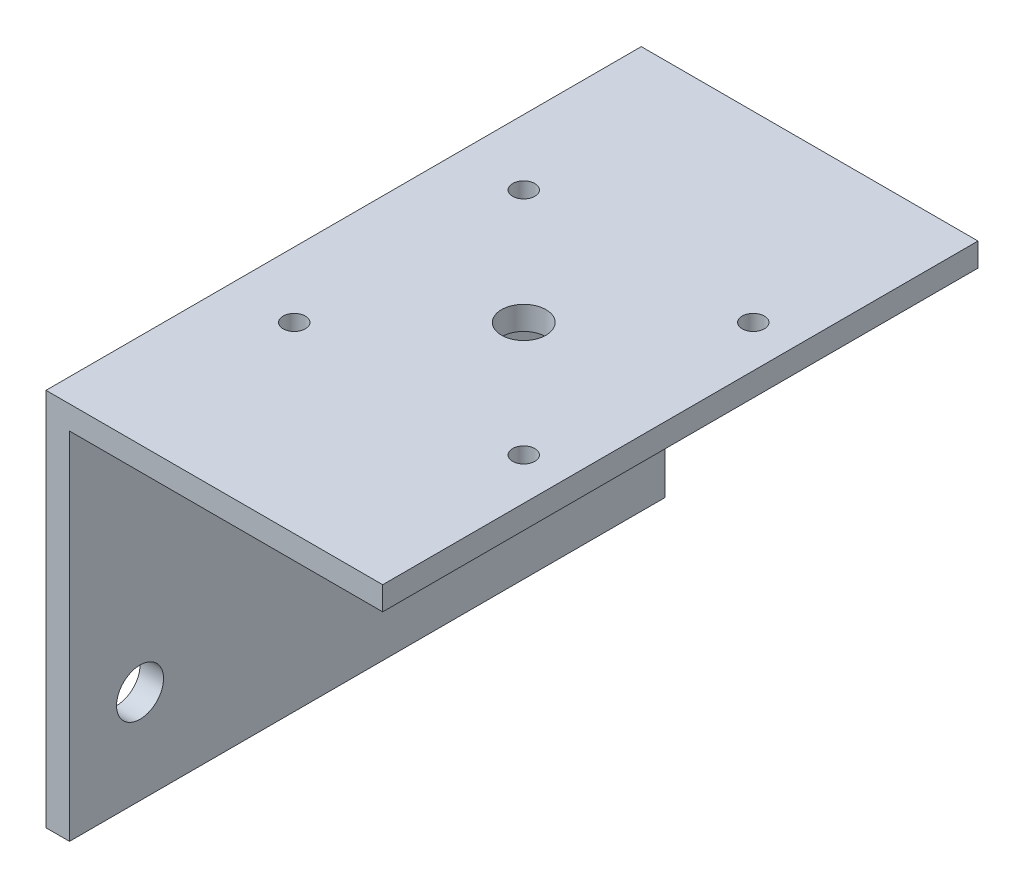
ISO-10303-21;
HEADER;
FILE_DESCRIPTION(('STEP AP214'),'2;1');
FILE_NAME('part.step','',(''),(''),'','','');
FILE_SCHEMA(('AUTOMOTIVE_DESIGN { 1 0 10303 214 1 1 1 1 }'));
ENDSEC;
DATA;
#1=APPLICATION_CONTEXT('core data for automotive mechanical design processes');
#2=APPLICATION_PROTOCOL_DEFINITION('international standard','automotive_design',2000,#1);
#3=PRODUCT_CONTEXT('',#1,'mechanical');
#4=PRODUCT('Part','Part','',(#3));
#5=PRODUCT_RELATED_PRODUCT_CATEGORY('part','',(#4));
#6=PRODUCT_DEFINITION_FORMATION('','',#4);
#7=PRODUCT_DEFINITION_CONTEXT('part definition',#1,'design');
#8=PRODUCT_DEFINITION('design','',#6,#7);
#9=PRODUCT_DEFINITION_SHAPE('','',#8);
#10=(LENGTH_UNIT() NAMED_UNIT(*) SI_UNIT(.MILLI.,.METRE.));
#11=(NAMED_UNIT(*) PLANE_ANGLE_UNIT() SI_UNIT($,.RADIAN.));
#12=(NAMED_UNIT(*) SI_UNIT($,.STERADIAN.) SOLID_ANGLE_UNIT());
#13=UNCERTAINTY_MEASURE_WITH_UNIT(LENGTH_MEASURE(1.E-05),#10,'distance_accuracy_value','');
#14=(GEOMETRIC_REPRESENTATION_CONTEXT(3) GLOBAL_UNCERTAINTY_ASSIGNED_CONTEXT((#13)) GLOBAL_UNIT_ASSIGNED_CONTEXT((#10,
#11,#12)) REPRESENTATION_CONTEXT('',''));
#15=CARTESIAN_POINT('',(0.,0.,0.));
#16=DIRECTION('',(0.,0.,1.));
#17=DIRECTION('',(1.,0.,0.));
#18=AXIS2_PLACEMENT_3D('',#15,#16,#17);
#19=CARTESIAN_POINT('',(0.,0.,80.4));
#20=DIRECTION('',(1.,0.,0.));
#21=DIRECTION('',(0.,0.,-1.));
#22=AXIS2_PLACEMENT_3D('',#19,#20,#21);
#23=PLANE('',#22);
#24=CARTESIAN_POINT('',(0.,12.7,9.52500000000001));
#25=DIRECTION('',(1.,0.,0.));
#26=DIRECTION('',(0.,0.,-1.));
#27=AXIS2_PLACEMENT_3D('',#24,#25,#26);
#28=CIRCLE('',#27,3.175);
#29=CARTESIAN_POINT('',(0.,12.7,6.35000000000001));
#30=VERTEX_POINT('',#29);
#31=EDGE_CURVE('E162',#30,#30,#28,.T.);
#32=ORIENTED_EDGE('',*,*,#31,.T.);
#33=EDGE_LOOP('',(#32));
#34=FACE_BOUND('',#33,.T.);
#35=CARTESIAN_POINT('',(0.,12.7,70.875));
#36=DIRECTION('',(1.,0.,0.));
#37=DIRECTION('',(0.,0.,-1.));
#38=AXIS2_PLACEMENT_3D('',#35,#36,#37);
#39=CIRCLE('',#38,3.175);
#40=CARTESIAN_POINT('',(0.,12.7,67.7));
#41=VERTEX_POINT('',#40);
#42=EDGE_CURVE('E120',#41,#41,#39,.T.);
#43=ORIENTED_EDGE('',*,*,#42,.T.);
#44=EDGE_LOOP('',(#43));
#45=FACE_BOUND('',#44,.T.);
#46=DIRECTION('',(0.,-1.,0.));
#47=VECTOR('',#46,1.);
#48=CARTESIAN_POINT('',(0.,0.,0.));
#49=LINE('',#48,#47);
#50=CARTESIAN_POINT('',(0.,51.175,0.));
#51=VERTEX_POINT('',#50);
#52=CARTESIAN_POINT('',(0.,0.,0.));
#53=VERTEX_POINT('',#52);
#54=EDGE_CURVE('E116',#51,#53,#49,.T.);
#55=ORIENTED_EDGE('',*,*,#54,.T.);
#56=DIRECTION('',(0.,0.,-1.));
#57=VECTOR('',#56,1.);
#58=CARTESIAN_POINT('',(0.,0.,80.4));
#59=LINE('',#58,#57);
#60=CARTESIAN_POINT('',(0.,0.,80.4));
#61=VERTEX_POINT('',#60);
#62=EDGE_CURVE('E11',#61,#53,#59,.T.);
#63=ORIENTED_EDGE('',*,*,#62,.F.);
#64=DIRECTION('',(0.,-1.,0.));
#65=VECTOR('',#64,1.);
#66=CARTESIAN_POINT('',(0.,0.,80.4));
#67=LINE('',#66,#65);
#68=CARTESIAN_POINT('',(0.,51.175,80.4));
#69=VERTEX_POINT('',#68);
#70=EDGE_CURVE('E127',#69,#61,#67,.T.);
#71=ORIENTED_EDGE('',*,*,#70,.F.);
#72=DIRECTION('',(0.,0.,-1.));
#73=VECTOR('',#72,1.);
#74=CARTESIAN_POINT('',(0.,51.175,80.4));
#75=LINE('',#74,#73);
#76=EDGE_CURVE('E112',#69,#51,#75,.T.);
#77=ORIENTED_EDGE('',*,*,#76,.T.);
#78=EDGE_LOOP('',(#55,#63,#71,#77));
#79=FACE_BOUND('',#78,.T.);
#80=ADVANCED_FACE('F32',(#34,#45,#79),#23,.F.);
#81=CARTESIAN_POINT('',(0.,0.,80.4));
#82=DIRECTION('',(0.,1.,0.));
#83=DIRECTION('',(-1.,0.,0.));
#84=AXIS2_PLACEMENT_3D('',#81,#82,#83);
#85=PLANE('',#84);
#86=DIRECTION('',(1.,0.,0.));
#87=VECTOR('',#86,1.);
#88=CARTESIAN_POINT('',(0.,0.,0.));
#89=LINE('',#88,#87);
#90=CARTESIAN_POINT('',(3.175,0.,0.));
#91=VERTEX_POINT('',#90);
#92=EDGE_CURVE('E119',#53,#91,#89,.T.);
#93=ORIENTED_EDGE('',*,*,#92,.T.);
#94=DIRECTION('',(0.,0.,-1.));
#95=VECTOR('',#94,1.);
#96=CARTESIAN_POINT('',(3.175,0.,80.4));
#97=LINE('',#96,#95);
#98=CARTESIAN_POINT('',(3.175,0.,80.4));
#99=VERTEX_POINT('',#98);
#100=EDGE_CURVE('E40',#99,#91,#97,.T.);
#101=ORIENTED_EDGE('',*,*,#100,.F.);
#102=DIRECTION('',(1.,0.,0.));
#103=VECTOR('',#102,1.);
#104=CARTESIAN_POINT('',(0.,0.,80.4));
#105=LINE('',#104,#103);
#106=EDGE_CURVE('E85',#61,#99,#105,.T.);
#107=ORIENTED_EDGE('',*,*,#106,.F.);
#108=ORIENTED_EDGE('',*,*,#62,.T.);
#109=EDGE_LOOP('',(#93,#101,#107,#108));
#110=FACE_BOUND('',#109,.T.);
#111=ADVANCED_FACE('F154',(#110),#85,.F.);
#112=CARTESIAN_POINT('',(3.175,0.,80.4));
#113=DIRECTION('',(-1.,0.,0.));
#114=DIRECTION('',(0.,0.,1.));
#115=AXIS2_PLACEMENT_3D('',#112,#113,#114);
#116=PLANE('',#115);
#117=CARTESIAN_POINT('',(3.175,12.7,9.52500000000001));
#118=DIRECTION('',(1.,0.,0.));
#119=DIRECTION('',(0.,0.,-1.));
#120=AXIS2_PLACEMENT_3D('',#117,#118,#119);
#121=CIRCLE('',#120,3.175);
#122=CARTESIAN_POINT('',(3.175,12.7,6.35000000000001));
#123=VERTEX_POINT('',#122);
#124=EDGE_CURVE('E171',#123,#123,#121,.T.);
#125=ORIENTED_EDGE('',*,*,#124,.F.);
#126=EDGE_LOOP('',(#125));
#127=FACE_BOUND('',#126,.T.);
#128=CARTESIAN_POINT('',(3.175,12.7,70.875));
#129=DIRECTION('',(1.,0.,0.));
#130=DIRECTION('',(0.,0.,-1.));
#131=AXIS2_PLACEMENT_3D('',#128,#129,#130);
#132=CIRCLE('',#131,3.175);
#133=CARTESIAN_POINT('',(3.175,12.7,67.7));
#134=VERTEX_POINT('',#133);
#135=EDGE_CURVE('E166',#134,#134,#132,.T.);
#136=ORIENTED_EDGE('',*,*,#135,.F.);
#137=EDGE_LOOP('',(#136));
#138=FACE_BOUND('',#137,.T.);
#139=DIRECTION('',(0.,1.,0.));
#140=VECTOR('',#139,1.);
#141=CARTESIAN_POINT('',(3.175,0.,0.));
#142=LINE('',#141,#140);
#143=CARTESIAN_POINT('',(3.175,48.,0.));
#144=VERTEX_POINT('',#143);
#145=EDGE_CURVE('E122',#91,#144,#142,.T.);
#146=ORIENTED_EDGE('',*,*,#145,.T.);
#147=DIRECTION('',(0.,0.,-1.));
#148=VECTOR('',#147,1.);
#149=CARTESIAN_POINT('',(3.175,48.,80.4));
#150=LINE('',#149,#148);
#151=CARTESIAN_POINT('',(3.175,48.,80.4));
#152=VERTEX_POINT('',#151);
#153=EDGE_CURVE('E107',#152,#144,#150,.T.);
#154=ORIENTED_EDGE('',*,*,#153,.F.);
#155=DIRECTION('',(0.,1.,0.));
#156=VECTOR('',#155,1.);
#157=CARTESIAN_POINT('',(3.175,0.,80.4));
#158=LINE('',#157,#156);
#159=EDGE_CURVE('E98',#99,#152,#158,.T.);
#160=ORIENTED_EDGE('',*,*,#159,.F.);
#161=ORIENTED_EDGE('',*,*,#100,.T.);
#162=EDGE_LOOP('',(#146,#154,#160,#161));
#163=FACE_BOUND('',#162,.T.);
#164=ADVANCED_FACE('F133',(#127,#138,#163),#116,.F.);
#165=CARTESIAN_POINT('',(45.475,48.,80.4));
#166=DIRECTION('',(0.,1.,0.));
#167=DIRECTION('',(-1.,0.,0.));
#168=AXIS2_PLACEMENT_3D('',#165,#166,#167);
#169=PLANE('',#168);
#170=CARTESIAN_POINT('',(24.325,48.,40.2));
#171=DIRECTION('',(0.,1.,0.));
#172=DIRECTION('',(-1.,0.,0.));
#173=AXIS2_PLACEMENT_3D('',#170,#171,#172);
#174=CIRCLE('',#173,3.);
#175=CARTESIAN_POINT('',(21.325,48.,40.2));
#176=VERTEX_POINT('',#175);
#177=EDGE_CURVE('E201',#176,#176,#174,.T.);
#178=ORIENTED_EDGE('',*,*,#177,.T.);
#179=EDGE_LOOP('',(#178));
#180=FACE_BOUND('',#179,.T.);
#181=CARTESIAN_POINT('',(39.825,48.,24.7));
#182=DIRECTION('',(0.,1.,0.));
#183=DIRECTION('',(-1.,0.,0.));
#184=AXIS2_PLACEMENT_3D('',#181,#182,#183);
#185=CIRCLE('',#184,1.5);
#186=CARTESIAN_POINT('',(38.325,48.,24.7));
#187=VERTEX_POINT('',#186);
#188=EDGE_CURVE('E195',#187,#187,#185,.T.);
#189=ORIENTED_EDGE('',*,*,#188,.T.);
#190=EDGE_LOOP('',(#189));
#191=FACE_BOUND('',#190,.T.);
#192=CARTESIAN_POINT('',(8.825,48.,24.7));
#193=DIRECTION('',(0.,1.,0.));
#194=DIRECTION('',(-1.,0.,0.));
#195=AXIS2_PLACEMENT_3D('',#192,#193,#194);
#196=CIRCLE('',#195,1.5);
#197=CARTESIAN_POINT('',(7.325,48.,24.7));
#198=VERTEX_POINT('',#197);
#199=EDGE_CURVE('E189',#198,#198,#196,.T.);
#200=ORIENTED_EDGE('',*,*,#199,.T.);
#201=EDGE_LOOP('',(#200));
#202=FACE_BOUND('',#201,.T.);
#203=CARTESIAN_POINT('',(8.82500000000001,48.,55.7));
#204=DIRECTION('',(0.,1.,0.));
#205=DIRECTION('',(-1.,0.,0.));
#206=AXIS2_PLACEMENT_3D('',#203,#204,#205);
#207=CIRCLE('',#206,1.5);
#208=CARTESIAN_POINT('',(7.32500000000001,48.,55.7));
#209=VERTEX_POINT('',#208);
#210=EDGE_CURVE('E183',#209,#209,#207,.T.);
#211=ORIENTED_EDGE('',*,*,#210,.T.);
#212=EDGE_LOOP('',(#211));
#213=FACE_BOUND('',#212,.T.);
#214=CARTESIAN_POINT('',(39.825,48.,55.7));
#215=DIRECTION('',(0.,1.,0.));
#216=DIRECTION('',(-1.,0.,0.));
#217=AXIS2_PLACEMENT_3D('',#214,#215,#216);
#218=CIRCLE('',#217,1.5);
#219=CARTESIAN_POINT('',(38.325,48.,55.7));
#220=VERTEX_POINT('',#219);
#221=EDGE_CURVE('E176',#220,#220,#218,.T.);
#222=ORIENTED_EDGE('',*,*,#221,.T.);
#223=EDGE_LOOP('',(#222));
#224=FACE_BOUND('',#223,.T.);
#225=DIRECTION('',(1.,0.,0.));
#226=VECTOR('',#225,1.);
#227=CARTESIAN_POINT('',(45.475,48.,0.));
#228=LINE('',#227,#226);
#229=CARTESIAN_POINT('',(45.475,48.,0.));
#230=VERTEX_POINT('',#229);
#231=EDGE_CURVE('E106',#144,#230,#228,.T.);
#232=ORIENTED_EDGE('',*,*,#231,.T.);
#233=DIRECTION('',(0.,0.,-1.));
#234=VECTOR('',#233,1.);
#235=CARTESIAN_POINT('',(45.475,48.,80.4));
#236=LINE('',#235,#234);
#237=CARTESIAN_POINT('',(45.475,48.,80.4));
#238=VERTEX_POINT('',#237);
#239=EDGE_CURVE('E103',#238,#230,#236,.T.);
#240=ORIENTED_EDGE('',*,*,#239,.F.);
#241=DIRECTION('',(1.,0.,0.));
#242=VECTOR('',#241,1.);
#243=CARTESIAN_POINT('',(45.475,48.,80.4));
#244=LINE('',#243,#242);
#245=EDGE_CURVE('E92',#152,#238,#244,.T.);
#246=ORIENTED_EDGE('',*,*,#245,.F.);
#247=ORIENTED_EDGE('',*,*,#153,.T.);
#248=EDGE_LOOP('',(#232,#240,#246,#247));
#249=FACE_BOUND('',#248,.T.);
#250=ADVANCED_FACE('F104',(#180,#191,#202,#213,#224,#249),#169,.F.);
#251=CARTESIAN_POINT('',(45.475,48.,80.4));
#252=DIRECTION('',(-1.,0.,0.));
#253=DIRECTION('',(0.,0.,1.));
#254=AXIS2_PLACEMENT_3D('',#251,#252,#253);
#255=PLANE('',#254);
#256=DIRECTION('',(0.,1.,0.));
#257=VECTOR('',#256,1.);
#258=CARTESIAN_POINT('',(45.475,48.,0.));
#259=LINE('',#258,#257);
#260=CARTESIAN_POINT('',(45.475,51.175,0.));
#261=VERTEX_POINT('',#260);
#262=EDGE_CURVE('E71',#230,#261,#259,.T.);
#263=ORIENTED_EDGE('',*,*,#262,.T.);
#264=DIRECTION('',(0.,0.,-1.));
#265=VECTOR('',#264,1.);
#266=CARTESIAN_POINT('',(45.475,51.175,80.4));
#267=LINE('',#266,#265);
#268=CARTESIAN_POINT('',(45.475,51.175,80.4));
#269=VERTEX_POINT('',#268);
#270=EDGE_CURVE('E108',#269,#261,#267,.T.);
#271=ORIENTED_EDGE('',*,*,#270,.F.);
#272=DIRECTION('',(0.,1.,0.));
#273=VECTOR('',#272,1.);
#274=CARTESIAN_POINT('',(45.475,48.,80.4));
#275=LINE('',#274,#273);
#276=EDGE_CURVE('E96',#238,#269,#275,.T.);
#277=ORIENTED_EDGE('',*,*,#276,.F.);
#278=ORIENTED_EDGE('',*,*,#239,.T.);
#279=EDGE_LOOP('',(#263,#271,#277,#278));
#280=FACE_BOUND('',#279,.T.);
#281=ADVANCED_FACE('F110',(#280),#255,.F.);
#282=CARTESIAN_POINT('',(0.,51.175,80.4));
#283=DIRECTION('',(0.,-1.,0.));
#284=DIRECTION('',(0.,0.,-1.));
#285=AXIS2_PLACEMENT_3D('',#282,#283,#284);
#286=PLANE('',#285);
#287=CARTESIAN_POINT('',(24.325,51.175,40.2));
#288=DIRECTION('',(0.,1.,0.));
#289=DIRECTION('',(0.,0.,1.));
#290=AXIS2_PLACEMENT_3D('',#287,#288,#289);
#291=CIRCLE('',#290,3.);
#292=CARTESIAN_POINT('',(24.325,51.175,43.2));
#293=VERTEX_POINT('',#292);
#294=EDGE_CURVE('E204',#293,#293,#291,.T.);
#295=ORIENTED_EDGE('',*,*,#294,.F.);
#296=EDGE_LOOP('',(#295));
#297=FACE_BOUND('',#296,.T.);
#298=CARTESIAN_POINT('',(39.825,51.175,24.7));
#299=DIRECTION('',(0.,1.,0.));
#300=DIRECTION('',(0.,0.,1.));
#301=AXIS2_PLACEMENT_3D('',#298,#299,#300);
#302=CIRCLE('',#301,1.5);
#303=CARTESIAN_POINT('',(39.825,51.175,26.2));
#304=VERTEX_POINT('',#303);
#305=EDGE_CURVE('E198',#304,#304,#302,.T.);
#306=ORIENTED_EDGE('',*,*,#305,.F.);
#307=EDGE_LOOP('',(#306));
#308=FACE_BOUND('',#307,.T.);
#309=CARTESIAN_POINT('',(8.825,51.175,24.7));
#310=DIRECTION('',(0.,1.,0.));
#311=DIRECTION('',(0.,0.,1.));
#312=AXIS2_PLACEMENT_3D('',#309,#310,#311);
#313=CIRCLE('',#312,1.5);
#314=CARTESIAN_POINT('',(8.825,51.175,26.2));
#315=VERTEX_POINT('',#314);
#316=EDGE_CURVE('E192',#315,#315,#313,.T.);
#317=ORIENTED_EDGE('',*,*,#316,.F.);
#318=EDGE_LOOP('',(#317));
#319=FACE_BOUND('',#318,.T.);
#320=CARTESIAN_POINT('',(8.82500000000001,51.175,55.7));
#321=DIRECTION('',(0.,1.,0.));
#322=DIRECTION('',(0.,0.,1.));
#323=AXIS2_PLACEMENT_3D('',#320,#321,#322);
#324=CIRCLE('',#323,1.5);
#325=CARTESIAN_POINT('',(8.82500000000001,51.175,57.2));
#326=VERTEX_POINT('',#325);
#327=EDGE_CURVE('E186',#326,#326,#324,.T.);
#328=ORIENTED_EDGE('',*,*,#327,.F.);
#329=EDGE_LOOP('',(#328));
#330=FACE_BOUND('',#329,.T.);
#331=CARTESIAN_POINT('',(39.825,51.175,55.7));
#332=DIRECTION('',(0.,1.,0.));
#333=DIRECTION('',(0.,0.,1.));
#334=AXIS2_PLACEMENT_3D('',#331,#332,#333);
#335=CIRCLE('',#334,1.5);
#336=CARTESIAN_POINT('',(39.825,51.175,57.2));
#337=VERTEX_POINT('',#336);
#338=EDGE_CURVE('E180',#337,#337,#335,.T.);
#339=ORIENTED_EDGE('',*,*,#338,.F.);
#340=EDGE_LOOP('',(#339));
#341=FACE_BOUND('',#340,.T.);
#342=DIRECTION('',(-1.,0.,0.));
#343=VECTOR('',#342,1.);
#344=CARTESIAN_POINT('',(0.,51.175,0.));
#345=LINE('',#344,#343);
#346=EDGE_CURVE('E77',#261,#51,#345,.T.);
#347=ORIENTED_EDGE('',*,*,#346,.T.);
#348=ORIENTED_EDGE('',*,*,#76,.F.);
#349=DIRECTION('',(-1.,0.,0.));
#350=VECTOR('',#349,1.);
#351=CARTESIAN_POINT('',(0.,51.175,80.4));
#352=LINE('',#351,#350);
#353=EDGE_CURVE('E48',#269,#69,#352,.T.);
#354=ORIENTED_EDGE('',*,*,#353,.F.);
#355=ORIENTED_EDGE('',*,*,#270,.T.);
#356=EDGE_LOOP('',(#347,#348,#354,#355));
#357=FACE_BOUND('',#356,.T.);
#358=ADVANCED_FACE('F140',(#297,#308,#319,#330,#341,#357),#286,.F.);
#359=CARTESIAN_POINT('',(0.,0.,80.4));
#360=DIRECTION('',(0.,0.,-1.));
#361=DIRECTION('',(-1.,0.,0.));
#362=AXIS2_PLACEMENT_3D('',#359,#360,#361);
#363=PLANE('',#362);
#364=ORIENTED_EDGE('',*,*,#70,.T.);
#365=ORIENTED_EDGE('',*,*,#106,.T.);
#366=ORIENTED_EDGE('',*,*,#159,.T.);
#367=ORIENTED_EDGE('',*,*,#245,.T.);
#368=ORIENTED_EDGE('',*,*,#276,.T.);
#369=ORIENTED_EDGE('',*,*,#353,.T.);
#370=EDGE_LOOP('',(#364,#365,#366,#367,#368,#369));
#371=FACE_BOUND('',#370,.T.);
#372=ADVANCED_FACE('F94',(#371),#363,.F.);
#373=CARTESIAN_POINT('',(0.,0.,0.));
#374=DIRECTION('',(0.,0.,-1.));
#375=DIRECTION('',(-1.,0.,0.));
#376=AXIS2_PLACEMENT_3D('',#373,#374,#375);
#377=PLANE('',#376);
#378=ORIENTED_EDGE('',*,*,#54,.F.);
#379=ORIENTED_EDGE('',*,*,#346,.F.);
#380=ORIENTED_EDGE('',*,*,#262,.F.);
#381=ORIENTED_EDGE('',*,*,#231,.F.);
#382=ORIENTED_EDGE('',*,*,#145,.F.);
#383=ORIENTED_EDGE('',*,*,#92,.F.);
#384=EDGE_LOOP('',(#378,#379,#380,#381,#382,#383));
#385=FACE_BOUND('',#384,.T.);
#386=ADVANCED_FACE('F136',(#385),#377,.T.);
#387=CARTESIAN_POINT('',(0.,12.7,70.875));
#388=DIRECTION('',(1.,0.,0.));
#389=DIRECTION('',(0.,0.,-1.));
#390=AXIS2_PLACEMENT_3D('',#387,#388,#389);
#391=CYLINDRICAL_SURFACE('',#390,3.175);
#392=ORIENTED_EDGE('',*,*,#42,.F.);
#393=EDGE_LOOP('',(#392));
#394=FACE_BOUND('',#393,.T.);
#395=ORIENTED_EDGE('',*,*,#135,.T.);
#396=EDGE_LOOP('',(#395));
#397=FACE_BOUND('',#396,.T.);
#398=ADVANCED_FACE('F238',(#394,#397),#391,.F.);
#399=CARTESIAN_POINT('',(0.,12.7,9.52500000000001));
#400=DIRECTION('',(1.,0.,0.));
#401=DIRECTION('',(0.,0.,-1.));
#402=AXIS2_PLACEMENT_3D('',#399,#400,#401);
#403=CYLINDRICAL_SURFACE('',#402,3.175);
#404=ORIENTED_EDGE('',*,*,#31,.F.);
#405=EDGE_LOOP('',(#404));
#406=FACE_BOUND('',#405,.T.);
#407=ORIENTED_EDGE('',*,*,#124,.T.);
#408=EDGE_LOOP('',(#407));
#409=FACE_BOUND('',#408,.T.);
#410=ADVANCED_FACE('F228',(#406,#409),#403,.F.);
#411=CARTESIAN_POINT('',(39.825,0.,55.7));
#412=DIRECTION('',(0.,1.,0.));
#413=DIRECTION('',(0.,0.,1.));
#414=AXIS2_PLACEMENT_3D('',#411,#412,#413);
#415=CYLINDRICAL_SURFACE('',#414,1.5);
#416=ORIENTED_EDGE('',*,*,#338,.T.);
#417=EDGE_LOOP('',(#416));
#418=FACE_BOUND('',#417,.T.);
#419=ORIENTED_EDGE('',*,*,#221,.F.);
#420=EDGE_LOOP('',(#419));
#421=FACE_BOUND('',#420,.T.);
#422=ADVANCED_FACE('F225',(#418,#421),#415,.F.);
#423=CARTESIAN_POINT('',(8.82500000000001,0.,55.7));
#424=DIRECTION('',(0.,1.,0.));
#425=DIRECTION('',(0.,0.,1.));
#426=AXIS2_PLACEMENT_3D('',#423,#424,#425);
#427=CYLINDRICAL_SURFACE('',#426,1.5);
#428=ORIENTED_EDGE('',*,*,#327,.T.);
#429=EDGE_LOOP('',(#428));
#430=FACE_BOUND('',#429,.T.);
#431=ORIENTED_EDGE('',*,*,#210,.F.);
#432=EDGE_LOOP('',(#431));
#433=FACE_BOUND('',#432,.T.);
#434=ADVANCED_FACE('F227',(#430,#433),#427,.F.);
#435=CARTESIAN_POINT('',(8.825,0.,24.7));
#436=DIRECTION('',(0.,1.,0.));
#437=DIRECTION('',(0.,0.,1.));
#438=AXIS2_PLACEMENT_3D('',#435,#436,#437);
#439=CYLINDRICAL_SURFACE('',#438,1.5);
#440=ORIENTED_EDGE('',*,*,#316,.T.);
#441=EDGE_LOOP('',(#440));
#442=FACE_BOUND('',#441,.T.);
#443=ORIENTED_EDGE('',*,*,#199,.F.);
#444=EDGE_LOOP('',(#443));
#445=FACE_BOUND('',#444,.T.);
#446=ADVANCED_FACE('F235',(#442,#445),#439,.F.);
#447=CARTESIAN_POINT('',(39.825,0.,24.7));
#448=DIRECTION('',(0.,1.,0.));
#449=DIRECTION('',(0.,0.,1.));
#450=AXIS2_PLACEMENT_3D('',#447,#448,#449);
#451=CYLINDRICAL_SURFACE('',#450,1.5);
#452=ORIENTED_EDGE('',*,*,#305,.T.);
#453=EDGE_LOOP('',(#452));
#454=FACE_BOUND('',#453,.T.);
#455=ORIENTED_EDGE('',*,*,#188,.F.);
#456=EDGE_LOOP('',(#455));
#457=FACE_BOUND('',#456,.T.);
#458=ADVANCED_FACE('F210',(#454,#457),#451,.F.);
#459=CARTESIAN_POINT('',(24.325,0.,40.2));
#460=DIRECTION('',(0.,1.,0.));
#461=DIRECTION('',(0.,0.,1.));
#462=AXIS2_PLACEMENT_3D('',#459,#460,#461);
#463=CYLINDRICAL_SURFACE('',#462,3.);
#464=ORIENTED_EDGE('',*,*,#294,.T.);
#465=EDGE_LOOP('',(#464));
#466=FACE_BOUND('',#465,.T.);
#467=ORIENTED_EDGE('',*,*,#177,.F.);
#468=EDGE_LOOP('',(#467));
#469=FACE_BOUND('',#468,.T.);
#470=ADVANCED_FACE('F207',(#466,#469),#463,.F.);
#471=CLOSED_SHELL('',(#80,#111,#164,#250,#281,#358,#372,#386,#398,#410,#422,#434,#446,#458,#470));
#472=MANIFOLD_SOLID_BREP('B2',#471);
#473=ADVANCED_BREP_SHAPE_REPRESENTATION('',(#18,#472),#14);
#474=SHAPE_DEFINITION_REPRESENTATION(#9,#473);
ENDSEC;
END-ISO-10303-21;
